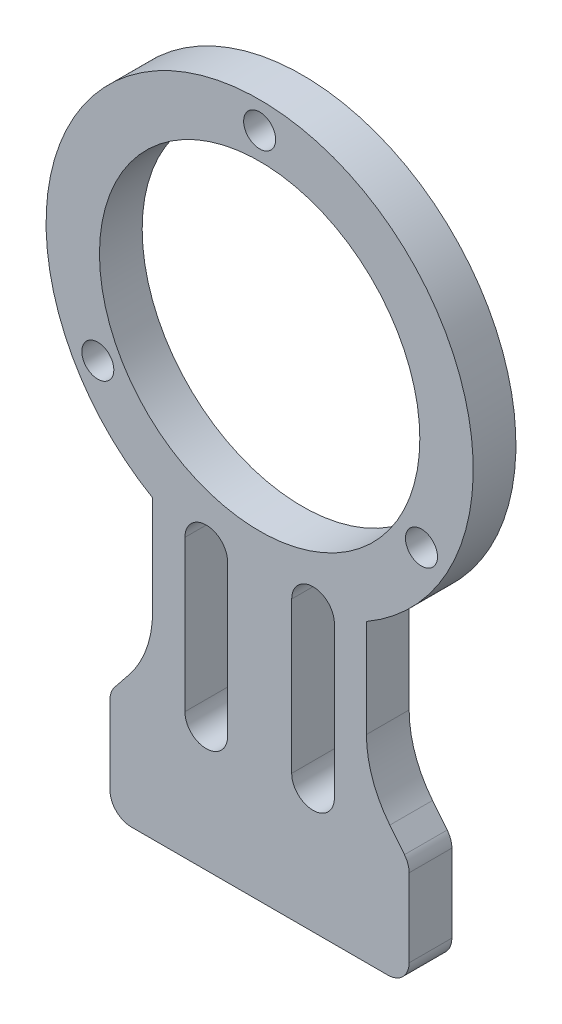
ISO-10303-21;
HEADER;
FILE_DESCRIPTION(('STEP AP214'),'2;1');
FILE_NAME('part.step','',(''),(''),'','','');
FILE_SCHEMA(('AUTOMOTIVE_DESIGN { 1 0 10303 214 1 1 1 1 }'));
ENDSEC;
DATA;
#1=APPLICATION_CONTEXT('core data for automotive mechanical design processes');
#2=APPLICATION_PROTOCOL_DEFINITION('international standard','automotive_design',2000,#1);
#3=PRODUCT_CONTEXT('',#1,'mechanical');
#4=PRODUCT('Part','Part','',(#3));
#5=PRODUCT_RELATED_PRODUCT_CATEGORY('part','',(#4));
#6=PRODUCT_DEFINITION_FORMATION('','',#4);
#7=PRODUCT_DEFINITION_CONTEXT('part definition',#1,'design');
#8=PRODUCT_DEFINITION('design','',#6,#7);
#9=PRODUCT_DEFINITION_SHAPE('','',#8);
#10=(LENGTH_UNIT() NAMED_UNIT(*) SI_UNIT(.MILLI.,.METRE.));
#11=(NAMED_UNIT(*) PLANE_ANGLE_UNIT() SI_UNIT($,.RADIAN.));
#12=(NAMED_UNIT(*) SI_UNIT($,.STERADIAN.) SOLID_ANGLE_UNIT());
#13=UNCERTAINTY_MEASURE_WITH_UNIT(LENGTH_MEASURE(1.E-05),#10,'distance_accuracy_value','');
#14=(GEOMETRIC_REPRESENTATION_CONTEXT(3) GLOBAL_UNCERTAINTY_ASSIGNED_CONTEXT((#13)) GLOBAL_UNIT_ASSIGNED_CONTEXT((#10,
#11,#12)) REPRESENTATION_CONTEXT('',''));
#15=CARTESIAN_POINT('',(0.,0.,0.));
#16=DIRECTION('',(0.,0.,1.));
#17=DIRECTION('',(1.,0.,0.));
#18=AXIS2_PLACEMENT_3D('',#15,#16,#17);
#19=CARTESIAN_POINT('',(0.,0.,4.));
#20=DIRECTION('',(0.,0.,1.));
#21=DIRECTION('',(1.,0.,0.));
#22=AXIS2_PLACEMENT_3D('',#19,#20,#21);
#23=PLANE('',#22);
#24=CARTESIAN_POINT('',(15.1554445662284,-8.74999999999956,4.));
#25=DIRECTION('',(0.,0.,1.));
#26=DIRECTION('',(1.,0.,0.));
#27=AXIS2_PLACEMENT_3D('',#24,#25,#26);
#28=CIRCLE('',#27,1.50000000000068);
#29=CARTESIAN_POINT('',(16.6554445662291,-8.74999999999956,4.));
#30=VERTEX_POINT('',#29);
#31=EDGE_CURVE('E259',#30,#30,#28,.T.);
#32=ORIENTED_EDGE('',*,*,#31,.F.);
#33=EDGE_LOOP('',(#32));
#34=FACE_BOUND('',#33,.T.);
#35=CARTESIAN_POINT('',(0.,0.,4.));
#36=DIRECTION('',(0.,0.,1.));
#37=DIRECTION('',(1.,0.,0.));
#38=AXIS2_PLACEMENT_3D('',#35,#36,#37);
#39=CIRCLE('',#38,15.);
#40=CARTESIAN_POINT('',(15.,0.,4.));
#41=VERTEX_POINT('',#40);
#42=EDGE_CURVE('E271',#41,#41,#39,.T.);
#43=ORIENTED_EDGE('',*,*,#42,.F.);
#44=EDGE_LOOP('',(#43));
#45=FACE_BOUND('',#44,.T.);
#46=CARTESIAN_POINT('',(0.,0.,4.));
#47=DIRECTION('',(0.,0.,1.));
#48=DIRECTION('',(1.,0.,0.));
#49=AXIS2_PLACEMENT_3D('',#46,#47,#48);
#50=CIRCLE('',#49,20.);
#51=CARTESIAN_POINT('',(10.,-17.3205080756888,4.));
#52=VERTEX_POINT('',#51);
#53=CARTESIAN_POINT('',(-10.0182127427132,-17.3099801687275,4.));
#54=VERTEX_POINT('',#53);
#55=EDGE_CURVE('E277',#52,#54,#50,.T.);
#56=ORIENTED_EDGE('',*,*,#55,.T.);
#57=DIRECTION('',(0.,-1.,0.));
#58=VECTOR('',#57,1.);
#59=CARTESIAN_POINT('',(-10.0182127427132,-17.3099801687275,4.));
#60=LINE('',#59,#58);
#61=CARTESIAN_POINT('',(-10.0182127427132,-26.4816614994566,4.));
#62=VERTEX_POINT('',#61);
#63=EDGE_CURVE('E280',#54,#62,#60,.T.);
#64=ORIENTED_EDGE('',*,*,#63,.T.);
#65=CARTESIAN_POINT('',(-20.0182127427132,-26.4816614994566,4.));
#66=DIRECTION('',(0.,0.,-1.));
#67=DIRECTION('',(1.,0.,0.));
#68=AXIS2_PLACEMENT_3D('',#65,#66,#67);
#69=CIRCLE('',#68,10.);
#70=CARTESIAN_POINT('',(-12.2095246482829,-32.7286119750008,4.));
#71=VERTEX_POINT('',#70);
#72=EDGE_CURVE('E283',#62,#71,#69,.T.);
#73=ORIENTED_EDGE('',*,*,#72,.T.);
#74=DIRECTION('',(-0.624695047554422,-0.780868809443032,0.));
#75=VECTOR('',#74,1.);
#76=CARTESIAN_POINT('',(-12.2095246482829,-32.7286119750008,4.));
#77=LINE('',#76,#75);
#78=CARTESIAN_POINT('',(-13.5799503615993,-34.4416441166463,4.));
#79=VERTEX_POINT('',#78);
#80=EDGE_CURVE('E285',#71,#79,#77,.T.);
#81=ORIENTED_EDGE('',*,*,#80,.T.);
#82=CARTESIAN_POINT('',(-12.0182127427132,-35.6910342117551,4.));
#83=DIRECTION('',(0.,0.,1.));
#84=DIRECTION('',(-1.,0.,0.));
#85=AXIS2_PLACEMENT_3D('',#82,#83,#84);
#86=CIRCLE('',#85,2.);
#87=CARTESIAN_POINT('',(-14.0182127427132,-35.6910342117551,4.));
#88=VERTEX_POINT('',#87);
#89=EDGE_CURVE('E287',#79,#88,#86,.T.);
#90=ORIENTED_EDGE('',*,*,#89,.T.);
#91=DIRECTION('',(0.,-1.,0.));
#92=VECTOR('',#91,1.);
#93=CARTESIAN_POINT('',(-14.0182127427132,-35.6910342117551,4.));
#94=LINE('',#93,#92);
#95=CARTESIAN_POINT('',(-14.0182127427132,-43.,4.));
#96=VERTEX_POINT('',#95);
#97=EDGE_CURVE('E289',#88,#96,#94,.T.);
#98=ORIENTED_EDGE('',*,*,#97,.T.);
#99=CARTESIAN_POINT('',(-12.0182127427132,-43.,4.));
#100=DIRECTION('',(0.,0.,1.));
#101=DIRECTION('',(-1.,0.,0.));
#102=AXIS2_PLACEMENT_3D('',#99,#100,#101);
#103=CIRCLE('',#102,2.);
#104=CARTESIAN_POINT('',(-12.0182127427132,-45.,4.));
#105=VERTEX_POINT('',#104);
#106=EDGE_CURVE('E291',#96,#105,#103,.T.);
#107=ORIENTED_EDGE('',*,*,#106,.T.);
#108=DIRECTION('',(1.,0.,0.));
#109=VECTOR('',#108,1.);
#110=CARTESIAN_POINT('',(12.,-45.,4.));
#111=LINE('',#110,#109);
#112=CARTESIAN_POINT('',(12.,-45.,4.));
#113=VERTEX_POINT('',#112);
#114=EDGE_CURVE('E293',#105,#113,#111,.T.);
#115=ORIENTED_EDGE('',*,*,#114,.T.);
#116=CARTESIAN_POINT('',(12.,-43.,4.));
#117=DIRECTION('',(0.,0.,1.));
#118=DIRECTION('',(1.,0.,0.));
#119=AXIS2_PLACEMENT_3D('',#116,#117,#118);
#120=CIRCLE('',#119,2.);
#121=CARTESIAN_POINT('',(14.,-43.,4.));
#122=VERTEX_POINT('',#121);
#123=EDGE_CURVE('E295',#113,#122,#120,.T.);
#124=ORIENTED_EDGE('',*,*,#123,.T.);
#125=DIRECTION('',(0.,1.,0.));
#126=VECTOR('',#125,1.);
#127=CARTESIAN_POINT('',(14.,-35.7015621187164,4.));
#128=LINE('',#127,#126);
#129=CARTESIAN_POINT('',(14.,-35.7015621187164,4.));
#130=VERTEX_POINT('',#129);
#131=EDGE_CURVE('E297',#122,#130,#128,.T.);
#132=ORIENTED_EDGE('',*,*,#131,.T.);
#133=CARTESIAN_POINT('',(12.,-35.7015621187164,4.));
#134=DIRECTION('',(0.,0.,1.));
#135=DIRECTION('',(1.,0.,0.));
#136=AXIS2_PLACEMENT_3D('',#133,#134,#135);
#137=CIRCLE('',#136,2.);
#138=CARTESIAN_POINT('',(13.5617376188861,-34.4521720236076,4.));
#139=VERTEX_POINT('',#138);
#140=EDGE_CURVE('E299',#130,#139,#137,.T.);
#141=ORIENTED_EDGE('',*,*,#140,.T.);
#142=DIRECTION('',(-0.624695047554425,0.78086880944303,0.));
#143=VECTOR('',#142,1.);
#144=CARTESIAN_POINT('',(12.1913119055697,-32.7391398819622,4.));
#145=LINE('',#144,#143);
#146=CARTESIAN_POINT('',(12.1913119055697,-32.7391398819622,4.));
#147=VERTEX_POINT('',#146);
#148=EDGE_CURVE('E301',#139,#147,#145,.T.);
#149=ORIENTED_EDGE('',*,*,#148,.T.);
#150=CARTESIAN_POINT('',(20.,-26.4921894064179,4.));
#151=DIRECTION('',(0.,0.,-1.));
#152=DIRECTION('',(1.,0.,0.));
#153=AXIS2_PLACEMENT_3D('',#150,#151,#152);
#154=CIRCLE('',#153,10.);
#155=CARTESIAN_POINT('',(10.,-26.4921894064178,4.));
#156=VERTEX_POINT('',#155);
#157=EDGE_CURVE('E303',#147,#156,#154,.T.);
#158=ORIENTED_EDGE('',*,*,#157,.T.);
#159=DIRECTION('',(0.,1.,0.));
#160=VECTOR('',#159,1.);
#161=CARTESIAN_POINT('',(10.,-17.3205080756888,4.));
#162=LINE('',#161,#160);
#163=EDGE_CURVE('E305',#156,#52,#162,.T.);
#164=ORIENTED_EDGE('',*,*,#163,.T.);
#165=EDGE_LOOP('',(#56,#64,#73,#81,#90,#98,#107,#115,#124,#132,#141,#149,#158,#164));
#166=FACE_BOUND('',#165,.T.);
#167=CARTESIAN_POINT('',(0.,17.5,4.));
#168=DIRECTION('',(0.,0.,1.));
#169=DIRECTION('',(1.,0.,0.));
#170=AXIS2_PLACEMENT_3D('',#167,#168,#169);
#171=CIRCLE('',#170,1.5);
#172=CARTESIAN_POINT('',(1.5,17.5,4.));
#173=VERTEX_POINT('',#172);
#174=EDGE_CURVE('E265',#173,#173,#171,.T.);
#175=ORIENTED_EDGE('',*,*,#174,.F.);
#176=EDGE_LOOP('',(#175));
#177=FACE_BOUND('',#176,.T.);
#178=CARTESIAN_POINT('',(-15.1554445662269,-8.75000000000044,4.));
#179=DIRECTION('',(0.,0.,1.));
#180=DIRECTION('',(1.,0.,0.));
#181=AXIS2_PLACEMENT_3D('',#178,#179,#180);
#182=CIRCLE('',#181,1.500000000001);
#183=CARTESIAN_POINT('',(-13.6554445662259,-8.75000000000044,4.));
#184=VERTEX_POINT('',#183);
#185=EDGE_CURVE('E253',#184,#184,#182,.T.);
#186=ORIENTED_EDGE('',*,*,#185,.F.);
#187=EDGE_LOOP('',(#186));
#188=FACE_BOUND('',#187,.T.);
#189=DIRECTION('',(0.,-1.,0.));
#190=VECTOR('',#189,1.);
#191=CARTESIAN_POINT('',(-7.,-19.,4.));
#192=LINE('',#191,#190);
#193=CARTESIAN_POINT('',(-7.,-19.,4.));
#194=VERTEX_POINT('',#193);
#195=CARTESIAN_POINT('',(-7.,-33.1393258404143,4.));
#196=VERTEX_POINT('',#195);
#197=EDGE_CURVE('E224',#194,#196,#192,.T.);
#198=ORIENTED_EDGE('',*,*,#197,.F.);
#199=CARTESIAN_POINT('',(-5.,-19.,4.));
#200=DIRECTION('',(0.,0.,1.));
#201=DIRECTION('',(1.,0.,0.));
#202=AXIS2_PLACEMENT_3D('',#199,#200,#201);
#203=CIRCLE('',#202,2.);
#204=CARTESIAN_POINT('',(-3.,-19.,4.));
#205=VERTEX_POINT('',#204);
#206=EDGE_CURVE('E222',#205,#194,#203,.T.);
#207=ORIENTED_EDGE('',*,*,#206,.F.);
#208=DIRECTION('',(0.,1.,0.));
#209=VECTOR('',#208,1.);
#210=CARTESIAN_POINT('',(-3.,-19.,4.));
#211=LINE('',#210,#209);
#212=CARTESIAN_POINT('',(-3.,-33.1393258404143,4.));
#213=VERTEX_POINT('',#212);
#214=EDGE_CURVE('E230',#213,#205,#211,.T.);
#215=ORIENTED_EDGE('',*,*,#214,.F.);
#216=CARTESIAN_POINT('',(-5.,-33.1393258404143,4.));
#217=DIRECTION('',(0.,0.,1.));
#218=DIRECTION('',(1.,0.,0.));
#219=AXIS2_PLACEMENT_3D('',#216,#217,#218);
#220=CIRCLE('',#219,2.);
#221=EDGE_CURVE('E227',#196,#213,#220,.T.);
#222=ORIENTED_EDGE('',*,*,#221,.F.);
#223=EDGE_LOOP('',(#198,#207,#215,#222));
#224=FACE_BOUND('',#223,.T.);
#225=DIRECTION('',(0.,-1.,0.));
#226=VECTOR('',#225,1.);
#227=CARTESIAN_POINT('',(3.,-19.,4.));
#228=LINE('',#227,#226);
#229=CARTESIAN_POINT('',(3.,-19.,4.));
#230=VERTEX_POINT('',#229);
#231=CARTESIAN_POINT('',(3.,-33.1393258404143,4.));
#232=VERTEX_POINT('',#231);
#233=EDGE_CURVE('E192',#230,#232,#228,.T.);
#234=ORIENTED_EDGE('',*,*,#233,.F.);
#235=CARTESIAN_POINT('',(5.,-19.,4.));
#236=DIRECTION('',(0.,0.,1.));
#237=DIRECTION('',(-1.,0.,0.));
#238=AXIS2_PLACEMENT_3D('',#235,#236,#237);
#239=CIRCLE('',#238,2.);
#240=CARTESIAN_POINT('',(7.,-19.,4.));
#241=VERTEX_POINT('',#240);
#242=EDGE_CURVE('E184',#241,#230,#239,.T.);
#243=ORIENTED_EDGE('',*,*,#242,.F.);
#244=DIRECTION('',(0.,1.,0.));
#245=VECTOR('',#244,1.);
#246=CARTESIAN_POINT('',(7.,-19.,4.));
#247=LINE('',#246,#245);
#248=CARTESIAN_POINT('',(7.,-33.1393258404143,4.));
#249=VERTEX_POINT('',#248);
#250=EDGE_CURVE('E206',#249,#241,#247,.T.);
#251=ORIENTED_EDGE('',*,*,#250,.F.);
#252=CARTESIAN_POINT('',(5.,-33.1393258404143,4.));
#253=DIRECTION('',(0.,0.,1.));
#254=DIRECTION('',(-1.,0.,0.));
#255=AXIS2_PLACEMENT_3D('',#252,#253,#254);
#256=CIRCLE('',#255,2.);
#257=EDGE_CURVE('E204',#232,#249,#256,.T.);
#258=ORIENTED_EDGE('',*,*,#257,.F.);
#259=EDGE_LOOP('',(#234,#243,#251,#258));
#260=FACE_BOUND('',#259,.T.);
#261=ADVANCED_FACE('F35',(#34,#45,#166,#177,#188,#224,#260),#23,.T.);
#262=CARTESIAN_POINT('',(0.,0.,0.));
#263=DIRECTION('',(0.,0.,1.));
#264=DIRECTION('',(1.,0.,0.));
#265=AXIS2_PLACEMENT_3D('',#262,#263,#264);
#266=PLANE('',#265);
#267=CARTESIAN_POINT('',(-5.,-19.,0.));
#268=DIRECTION('',(0.,0.,1.));
#269=DIRECTION('',(1.,0.,0.));
#270=AXIS2_PLACEMENT_3D('',#267,#268,#269);
#271=CIRCLE('',#270,2.);
#272=CARTESIAN_POINT('',(-3.,-19.,0.));
#273=VERTEX_POINT('',#272);
#274=CARTESIAN_POINT('',(-7.,-19.,0.));
#275=VERTEX_POINT('',#274);
#276=EDGE_CURVE('E200',#273,#275,#271,.T.);
#277=ORIENTED_EDGE('',*,*,#276,.T.);
#278=DIRECTION('',(0.,-1.,0.));
#279=VECTOR('',#278,1.);
#280=CARTESIAN_POINT('',(-7.,-19.,0.));
#281=LINE('',#280,#279);
#282=CARTESIAN_POINT('',(-7.,-33.1393258404143,0.));
#283=VERTEX_POINT('',#282);
#284=EDGE_CURVE('E235',#275,#283,#281,.T.);
#285=ORIENTED_EDGE('',*,*,#284,.T.);
#286=CARTESIAN_POINT('',(-5.,-33.1393258404143,0.));
#287=DIRECTION('',(0.,0.,1.));
#288=DIRECTION('',(1.,0.,0.));
#289=AXIS2_PLACEMENT_3D('',#286,#287,#288);
#290=CIRCLE('',#289,2.);
#291=CARTESIAN_POINT('',(-3.,-33.1393258404143,0.));
#292=VERTEX_POINT('',#291);
#293=EDGE_CURVE('E238',#283,#292,#290,.T.);
#294=ORIENTED_EDGE('',*,*,#293,.T.);
#295=DIRECTION('',(0.,1.,0.));
#296=VECTOR('',#295,1.);
#297=CARTESIAN_POINT('',(-3.,-19.,0.));
#298=LINE('',#297,#296);
#299=EDGE_CURVE('E225',#292,#273,#298,.T.);
#300=ORIENTED_EDGE('',*,*,#299,.T.);
#301=EDGE_LOOP('',(#277,#285,#294,#300));
#302=FACE_BOUND('',#301,.T.);
#303=CARTESIAN_POINT('',(0.,0.,0.));
#304=DIRECTION('',(0.,0.,1.));
#305=DIRECTION('',(1.,0.,0.));
#306=AXIS2_PLACEMENT_3D('',#303,#304,#305);
#307=CIRCLE('',#306,20.);
#308=CARTESIAN_POINT('',(10.,-17.3205080756888,0.));
#309=VERTEX_POINT('',#308);
#310=CARTESIAN_POINT('',(-10.0182127427132,-17.3099801687275,0.));
#311=VERTEX_POINT('',#310);
#312=EDGE_CURVE('E274',#309,#311,#307,.T.);
#313=ORIENTED_EDGE('',*,*,#312,.F.);
#314=DIRECTION('',(0.,1.,0.));
#315=VECTOR('',#314,1.);
#316=CARTESIAN_POINT('',(10.,-17.3205080756888,0.));
#317=LINE('',#316,#315);
#318=CARTESIAN_POINT('',(10.,-26.4921894064178,0.));
#319=VERTEX_POINT('',#318);
#320=EDGE_CURVE('E281',#319,#309,#317,.T.);
#321=ORIENTED_EDGE('',*,*,#320,.F.);
#322=CARTESIAN_POINT('',(20.,-26.4921894064179,0.));
#323=DIRECTION('',(0.,0.,-1.));
#324=DIRECTION('',(1.,0.,0.));
#325=AXIS2_PLACEMENT_3D('',#322,#323,#324);
#326=CIRCLE('',#325,10.);
#327=CARTESIAN_POINT('',(12.1913119055697,-32.7391398819622,0.));
#328=VERTEX_POINT('',#327);
#329=EDGE_CURVE('E332',#328,#319,#326,.T.);
#330=ORIENTED_EDGE('',*,*,#329,.F.);
#331=DIRECTION('',(-0.624695047554425,0.78086880944303,0.));
#332=VECTOR('',#331,1.);
#333=CARTESIAN_POINT('',(12.1913119055697,-32.7391398819622,0.));
#334=LINE('',#333,#332);
#335=CARTESIAN_POINT('',(13.5617376188861,-34.4521720236076,0.));
#336=VERTEX_POINT('',#335);
#337=EDGE_CURVE('E330',#336,#328,#334,.T.);
#338=ORIENTED_EDGE('',*,*,#337,.F.);
#339=CARTESIAN_POINT('',(12.,-35.7015621187164,0.));
#340=DIRECTION('',(0.,0.,1.));
#341=DIRECTION('',(1.,0.,0.));
#342=AXIS2_PLACEMENT_3D('',#339,#340,#341);
#343=CIRCLE('',#342,2.);
#344=CARTESIAN_POINT('',(14.,-35.7015621187164,0.));
#345=VERTEX_POINT('',#344);
#346=EDGE_CURVE('E328',#345,#336,#343,.T.);
#347=ORIENTED_EDGE('',*,*,#346,.F.);
#348=DIRECTION('',(0.,1.,0.));
#349=VECTOR('',#348,1.);
#350=CARTESIAN_POINT('',(14.,-35.7015621187164,0.));
#351=LINE('',#350,#349);
#352=CARTESIAN_POINT('',(14.,-43.,0.));
#353=VERTEX_POINT('',#352);
#354=EDGE_CURVE('E326',#353,#345,#351,.T.);
#355=ORIENTED_EDGE('',*,*,#354,.F.);
#356=CARTESIAN_POINT('',(12.,-43.,0.));
#357=DIRECTION('',(0.,0.,1.));
#358=DIRECTION('',(1.,0.,0.));
#359=AXIS2_PLACEMENT_3D('',#356,#357,#358);
#360=CIRCLE('',#359,2.);
#361=CARTESIAN_POINT('',(12.,-45.,0.));
#362=VERTEX_POINT('',#361);
#363=EDGE_CURVE('E324',#362,#353,#360,.T.);
#364=ORIENTED_EDGE('',*,*,#363,.F.);
#365=DIRECTION('',(1.,0.,0.));
#366=VECTOR('',#365,1.);
#367=CARTESIAN_POINT('',(12.,-45.,0.));
#368=LINE('',#367,#366);
#369=CARTESIAN_POINT('',(-12.0182127427132,-45.,0.));
#370=VERTEX_POINT('',#369);
#371=EDGE_CURVE('E322',#370,#362,#368,.T.);
#372=ORIENTED_EDGE('',*,*,#371,.F.);
#373=CARTESIAN_POINT('',(-12.0182127427132,-43.,0.));
#374=DIRECTION('',(0.,0.,1.));
#375=DIRECTION('',(-1.,0.,0.));
#376=AXIS2_PLACEMENT_3D('',#373,#374,#375);
#377=CIRCLE('',#376,2.);
#378=CARTESIAN_POINT('',(-14.0182127427132,-43.,0.));
#379=VERTEX_POINT('',#378);
#380=EDGE_CURVE('E320',#379,#370,#377,.T.);
#381=ORIENTED_EDGE('',*,*,#380,.F.);
#382=DIRECTION('',(0.,-1.,0.));
#383=VECTOR('',#382,1.);
#384=CARTESIAN_POINT('',(-14.0182127427132,-35.6910342117551,0.));
#385=LINE('',#384,#383);
#386=CARTESIAN_POINT('',(-14.0182127427132,-35.6910342117551,0.));
#387=VERTEX_POINT('',#386);
#388=EDGE_CURVE('E318',#387,#379,#385,.T.);
#389=ORIENTED_EDGE('',*,*,#388,.F.);
#390=CARTESIAN_POINT('',(-12.0182127427132,-35.6910342117551,0.));
#391=DIRECTION('',(0.,0.,1.));
#392=DIRECTION('',(-1.,0.,0.));
#393=AXIS2_PLACEMENT_3D('',#390,#391,#392);
#394=CIRCLE('',#393,2.);
#395=CARTESIAN_POINT('',(-13.5799503615993,-34.4416441166463,0.));
#396=VERTEX_POINT('',#395);
#397=EDGE_CURVE('E316',#396,#387,#394,.T.);
#398=ORIENTED_EDGE('',*,*,#397,.F.);
#399=DIRECTION('',(-0.624695047554422,-0.780868809443032,0.));
#400=VECTOR('',#399,1.);
#401=CARTESIAN_POINT('',(-12.2095246482829,-32.7286119750008,0.));
#402=LINE('',#401,#400);
#403=CARTESIAN_POINT('',(-12.2095246482829,-32.7286119750008,0.));
#404=VERTEX_POINT('',#403);
#405=EDGE_CURVE('E314',#404,#396,#402,.T.);
#406=ORIENTED_EDGE('',*,*,#405,.F.);
#407=CARTESIAN_POINT('',(-20.0182127427132,-26.4816614994566,0.));
#408=DIRECTION('',(0.,0.,-1.));
#409=DIRECTION('',(1.,0.,0.));
#410=AXIS2_PLACEMENT_3D('',#407,#408,#409);
#411=CIRCLE('',#410,10.);
#412=CARTESIAN_POINT('',(-10.0182127427132,-26.4816614994566,0.));
#413=VERTEX_POINT('',#412);
#414=EDGE_CURVE('E312',#413,#404,#411,.T.);
#415=ORIENTED_EDGE('',*,*,#414,.F.);
#416=DIRECTION('',(0.,-1.,0.));
#417=VECTOR('',#416,1.);
#418=CARTESIAN_POINT('',(-10.0182127427132,-17.3099801687275,0.));
#419=LINE('',#418,#417);
#420=EDGE_CURVE('E310',#311,#413,#419,.T.);
#421=ORIENTED_EDGE('',*,*,#420,.F.);
#422=EDGE_LOOP('',(#313,#321,#330,#338,#347,#355,#364,#372,#381,#389,#398,#406,#415,#421));
#423=FACE_BOUND('',#422,.T.);
#424=CARTESIAN_POINT('',(0.,0.,0.));
#425=DIRECTION('',(0.,0.,1.));
#426=DIRECTION('',(1.,0.,0.));
#427=AXIS2_PLACEMENT_3D('',#424,#425,#426);
#428=CIRCLE('',#427,15.);
#429=CARTESIAN_POINT('',(15.,0.,0.));
#430=VERTEX_POINT('',#429);
#431=EDGE_CURVE('E268',#430,#430,#428,.T.);
#432=ORIENTED_EDGE('',*,*,#431,.T.);
#433=EDGE_LOOP('',(#432));
#434=FACE_BOUND('',#433,.T.);
#435=CARTESIAN_POINT('',(0.,17.5,0.));
#436=DIRECTION('',(0.,0.,1.));
#437=DIRECTION('',(1.,0.,0.));
#438=AXIS2_PLACEMENT_3D('',#435,#436,#437);
#439=CIRCLE('',#438,1.5);
#440=CARTESIAN_POINT('',(1.5,17.5,0.));
#441=VERTEX_POINT('',#440);
#442=EDGE_CURVE('E262',#441,#441,#439,.T.);
#443=ORIENTED_EDGE('',*,*,#442,.T.);
#444=EDGE_LOOP('',(#443));
#445=FACE_BOUND('',#444,.T.);
#446=CARTESIAN_POINT('',(15.1554445662284,-8.74999999999956,0.));
#447=DIRECTION('',(0.,0.,1.));
#448=DIRECTION('',(1.,0.,0.));
#449=AXIS2_PLACEMENT_3D('',#446,#447,#448);
#450=CIRCLE('',#449,1.50000000000068);
#451=CARTESIAN_POINT('',(16.6554445662291,-8.74999999999956,0.));
#452=VERTEX_POINT('',#451);
#453=EDGE_CURVE('E256',#452,#452,#450,.T.);
#454=ORIENTED_EDGE('',*,*,#453,.T.);
#455=EDGE_LOOP('',(#454));
#456=FACE_BOUND('',#455,.T.);
#457=CARTESIAN_POINT('',(-15.1554445662269,-8.75000000000044,0.));
#458=DIRECTION('',(0.,0.,1.));
#459=DIRECTION('',(1.,0.,0.));
#460=AXIS2_PLACEMENT_3D('',#457,#458,#459);
#461=CIRCLE('',#460,1.500000000001);
#462=CARTESIAN_POINT('',(-13.6554445662259,-8.75000000000044,0.));
#463=VERTEX_POINT('',#462);
#464=EDGE_CURVE('E252',#463,#463,#461,.T.);
#465=ORIENTED_EDGE('',*,*,#464,.T.);
#466=EDGE_LOOP('',(#465));
#467=FACE_BOUND('',#466,.T.);
#468=CARTESIAN_POINT('',(5.,-19.,0.));
#469=DIRECTION('',(0.,0.,1.));
#470=DIRECTION('',(-1.,0.,0.));
#471=AXIS2_PLACEMENT_3D('',#468,#469,#470);
#472=CIRCLE('',#471,2.);
#473=CARTESIAN_POINT('',(7.,-19.,0.));
#474=VERTEX_POINT('',#473);
#475=CARTESIAN_POINT('',(3.,-19.,0.));
#476=VERTEX_POINT('',#475);
#477=EDGE_CURVE('E58',#474,#476,#472,.T.);
#478=ORIENTED_EDGE('',*,*,#477,.T.);
#479=DIRECTION('',(0.,-1.,0.));
#480=VECTOR('',#479,1.);
#481=CARTESIAN_POINT('',(3.,-19.,0.));
#482=LINE('',#481,#480);
#483=CARTESIAN_POINT('',(3.,-33.1393258404143,0.));
#484=VERTEX_POINT('',#483);
#485=EDGE_CURVE('E199',#476,#484,#482,.T.);
#486=ORIENTED_EDGE('',*,*,#485,.T.);
#487=CARTESIAN_POINT('',(5.,-33.1393258404143,0.));
#488=DIRECTION('',(0.,0.,1.));
#489=DIRECTION('',(-1.,0.,0.));
#490=AXIS2_PLACEMENT_3D('',#487,#488,#489);
#491=CIRCLE('',#490,2.);
#492=CARTESIAN_POINT('',(7.,-33.1393258404143,0.));
#493=VERTEX_POINT('',#492);
#494=EDGE_CURVE('E214',#484,#493,#491,.T.);
#495=ORIENTED_EDGE('',*,*,#494,.T.);
#496=DIRECTION('',(0.,1.,0.));
#497=VECTOR('',#496,1.);
#498=CARTESIAN_POINT('',(7.,-19.,0.));
#499=LINE('',#498,#497);
#500=EDGE_CURVE('E193',#493,#474,#499,.T.);
#501=ORIENTED_EDGE('',*,*,#500,.T.);
#502=EDGE_LOOP('',(#478,#486,#495,#501));
#503=FACE_BOUND('',#502,.T.);
#504=ADVANCED_FACE('F380',(#302,#423,#434,#445,#456,#467,#503),#266,.F.);
#505=CARTESIAN_POINT('',(0.,0.,4.));
#506=DIRECTION('',(0.,0.,-1.));
#507=DIRECTION('',(-1.,0.,0.));
#508=AXIS2_PLACEMENT_3D('',#505,#506,#507);
#509=CYLINDRICAL_SURFACE('',#508,20.);
#510=ORIENTED_EDGE('',*,*,#312,.T.);
#511=DIRECTION('',(0.,0.,-1.));
#512=VECTOR('',#511,1.);
#513=CARTESIAN_POINT('',(-10.0182127427132,-17.3099801687275,4.));
#514=LINE('',#513,#512);
#515=EDGE_CURVE('E11',#54,#311,#514,.T.);
#516=ORIENTED_EDGE('',*,*,#515,.F.);
#517=ORIENTED_EDGE('',*,*,#55,.F.);
#518=DIRECTION('',(0.,0.,-1.));
#519=VECTOR('',#518,1.);
#520=CARTESIAN_POINT('',(10.,-17.3205080756888,4.));
#521=LINE('',#520,#519);
#522=EDGE_CURVE('E307',#52,#309,#521,.T.);
#523=ORIENTED_EDGE('',*,*,#522,.T.);
#524=EDGE_LOOP('',(#510,#516,#517,#523));
#525=FACE_BOUND('',#524,.T.);
#526=ADVANCED_FACE('F37',(#525),#509,.T.);
#527=CARTESIAN_POINT('',(-10.0182127427132,-17.3099801687275,4.));
#528=DIRECTION('',(1.,0.,0.));
#529=DIRECTION('',(0.,0.,-1.));
#530=AXIS2_PLACEMENT_3D('',#527,#528,#529);
#531=PLANE('',#530);
#532=ORIENTED_EDGE('',*,*,#420,.T.);
#533=DIRECTION('',(0.,0.,-1.));
#534=VECTOR('',#533,1.);
#535=CARTESIAN_POINT('',(-10.0182127427132,-26.4816614994566,4.));
#536=LINE('',#535,#534);
#537=EDGE_CURVE('E43',#62,#413,#536,.T.);
#538=ORIENTED_EDGE('',*,*,#537,.F.);
#539=ORIENTED_EDGE('',*,*,#63,.F.);
#540=ORIENTED_EDGE('',*,*,#515,.T.);
#541=EDGE_LOOP('',(#532,#538,#539,#540));
#542=FACE_BOUND('',#541,.T.);
#543=ADVANCED_FACE('F398',(#542),#531,.F.);
#544=CARTESIAN_POINT('',(-20.0182127427132,-26.4816614994566,4.));
#545=DIRECTION('',(0.,0.,-1.));
#546=DIRECTION('',(-1.,0.,0.));
#547=AXIS2_PLACEMENT_3D('',#544,#545,#546);
#548=CYLINDRICAL_SURFACE('',#547,10.);
#549=ORIENTED_EDGE('',*,*,#414,.T.);
#550=DIRECTION('',(0.,0.,-1.));
#551=VECTOR('',#550,1.);
#552=CARTESIAN_POINT('',(-12.2095246482829,-32.7286119750008,4.));
#553=LINE('',#552,#551);
#554=EDGE_CURVE('E367',#71,#404,#553,.T.);
#555=ORIENTED_EDGE('',*,*,#554,.F.);
#556=ORIENTED_EDGE('',*,*,#72,.F.);
#557=ORIENTED_EDGE('',*,*,#537,.T.);
#558=EDGE_LOOP('',(#549,#555,#556,#557));
#559=FACE_BOUND('',#558,.T.);
#560=ADVANCED_FACE('F374',(#559),#548,.F.);
#561=CARTESIAN_POINT('',(-12.2095246482829,-32.7286119750008,4.));
#562=DIRECTION('',(0.780868809443032,-0.624695047554422,0.));
#563=DIRECTION('',(0.624695047554422,0.780868809443032,0.));
#564=AXIS2_PLACEMENT_3D('',#561,#562,#563);
#565=PLANE('',#564);
#566=ORIENTED_EDGE('',*,*,#405,.T.);
#567=DIRECTION('',(0.,0.,-1.));
#568=VECTOR('',#567,1.);
#569=CARTESIAN_POINT('',(-13.5799503615993,-34.4416441166463,4.));
#570=LINE('',#569,#568);
#571=EDGE_CURVE('E364',#79,#396,#570,.T.);
#572=ORIENTED_EDGE('',*,*,#571,.F.);
#573=ORIENTED_EDGE('',*,*,#80,.F.);
#574=ORIENTED_EDGE('',*,*,#554,.T.);
#575=EDGE_LOOP('',(#566,#572,#573,#574));
#576=FACE_BOUND('',#575,.T.);
#577=ADVANCED_FACE('F386',(#576),#565,.F.);
#578=CARTESIAN_POINT('',(-12.0182127427132,-35.6910342117551,4.));
#579=DIRECTION('',(0.,0.,-1.));
#580=DIRECTION('',(-1.,0.,0.));
#581=AXIS2_PLACEMENT_3D('',#578,#579,#580);
#582=CYLINDRICAL_SURFACE('',#581,2.);
#583=ORIENTED_EDGE('',*,*,#397,.T.);
#584=DIRECTION('',(0.,0.,-1.));
#585=VECTOR('',#584,1.);
#586=CARTESIAN_POINT('',(-14.0182127427132,-35.6910342117551,4.));
#587=LINE('',#586,#585);
#588=EDGE_CURVE('E361',#88,#387,#587,.T.);
#589=ORIENTED_EDGE('',*,*,#588,.F.);
#590=ORIENTED_EDGE('',*,*,#89,.F.);
#591=ORIENTED_EDGE('',*,*,#571,.T.);
#592=EDGE_LOOP('',(#583,#589,#590,#591));
#593=FACE_BOUND('',#592,.T.);
#594=ADVANCED_FACE('F390',(#593),#582,.T.);
#595=CARTESIAN_POINT('',(-14.0182127427132,-35.6910342117551,4.));
#596=DIRECTION('',(1.,0.,0.));
#597=DIRECTION('',(0.,0.,-1.));
#598=AXIS2_PLACEMENT_3D('',#595,#596,#597);
#599=PLANE('',#598);
#600=ORIENTED_EDGE('',*,*,#388,.T.);
#601=DIRECTION('',(0.,0.,-1.));
#602=VECTOR('',#601,1.);
#603=CARTESIAN_POINT('',(-14.0182127427132,-43.,4.));
#604=LINE('',#603,#602);
#605=EDGE_CURVE('E358',#96,#379,#604,.T.);
#606=ORIENTED_EDGE('',*,*,#605,.F.);
#607=ORIENTED_EDGE('',*,*,#97,.F.);
#608=ORIENTED_EDGE('',*,*,#588,.T.);
#609=EDGE_LOOP('',(#600,#606,#607,#608));
#610=FACE_BOUND('',#609,.T.);
#611=ADVANCED_FACE('F441',(#610),#599,.F.);
#612=CARTESIAN_POINT('',(-12.0182127427132,-43.,4.));
#613=DIRECTION('',(0.,0.,-1.));
#614=DIRECTION('',(-1.,0.,0.));
#615=AXIS2_PLACEMENT_3D('',#612,#613,#614);
#616=CYLINDRICAL_SURFACE('',#615,2.);
#617=ORIENTED_EDGE('',*,*,#380,.T.);
#618=DIRECTION('',(0.,0.,-1.));
#619=VECTOR('',#618,1.);
#620=CARTESIAN_POINT('',(-12.0182127427132,-45.,4.));
#621=LINE('',#620,#619);
#622=EDGE_CURVE('E355',#105,#370,#621,.T.);
#623=ORIENTED_EDGE('',*,*,#622,.F.);
#624=ORIENTED_EDGE('',*,*,#106,.F.);
#625=ORIENTED_EDGE('',*,*,#605,.T.);
#626=EDGE_LOOP('',(#617,#623,#624,#625));
#627=FACE_BOUND('',#626,.T.);
#628=ADVANCED_FACE('F439',(#627),#616,.T.);
#629=CARTESIAN_POINT('',(12.,-45.,4.));
#630=DIRECTION('',(0.,1.,0.));
#631=DIRECTION('',(0.,0.,1.));
#632=AXIS2_PLACEMENT_3D('',#629,#630,#631);
#633=PLANE('',#632);
#634=CARTESIAN_POINT('',(-10.0091063713566,-45.,2.));
#635=DIRECTION('',(0.,-1.,0.));
#636=DIRECTION('',(0.,0.,-1.));
#637=AXIS2_PLACEMENT_3D('',#634,#635,#636);
#638=CIRCLE('',#637,1.);
#639=CARTESIAN_POINT('',(-10.0091063713566,-45.,1.));
#640=VERTEX_POINT('',#639);
#641=EDGE_CURVE('E483',#640,#640,#638,.T.);
#642=ORIENTED_EDGE('',*,*,#641,.F.);
#643=EDGE_LOOP('',(#642));
#644=FACE_BOUND('',#643,.T.);
#645=CARTESIAN_POINT('',(9.99089362864339,-45.,2.));
#646=DIRECTION('',(0.,-1.,0.));
#647=DIRECTION('',(0.,0.,1.));
#648=AXIS2_PLACEMENT_3D('',#645,#646,#647);
#649=CIRCLE('',#648,1.);
#650=CARTESIAN_POINT('',(9.99089362864339,-45.,3.));
#651=VERTEX_POINT('',#650);
#652=EDGE_CURVE('E486',#651,#651,#649,.T.);
#653=ORIENTED_EDGE('',*,*,#652,.F.);
#654=EDGE_LOOP('',(#653));
#655=FACE_BOUND('',#654,.T.);
#656=ORIENTED_EDGE('',*,*,#371,.T.);
#657=DIRECTION('',(0.,0.,-1.));
#658=VECTOR('',#657,1.);
#659=CARTESIAN_POINT('',(12.,-45.,4.));
#660=LINE('',#659,#658);
#661=EDGE_CURVE('E352',#113,#362,#660,.T.);
#662=ORIENTED_EDGE('',*,*,#661,.F.);
#663=ORIENTED_EDGE('',*,*,#114,.F.);
#664=ORIENTED_EDGE('',*,*,#622,.T.);
#665=EDGE_LOOP('',(#656,#662,#663,#664));
#666=FACE_BOUND('',#665,.T.);
#667=ADVANCED_FACE('F434',(#644,#655,#666),#633,.F.);
#668=CARTESIAN_POINT('',(12.,-43.,4.));
#669=DIRECTION('',(0.,0.,-1.));
#670=DIRECTION('',(-1.,0.,0.));
#671=AXIS2_PLACEMENT_3D('',#668,#669,#670);
#672=CYLINDRICAL_SURFACE('',#671,2.);
#673=ORIENTED_EDGE('',*,*,#363,.T.);
#674=DIRECTION('',(0.,0.,-1.));
#675=VECTOR('',#674,1.);
#676=CARTESIAN_POINT('',(14.,-43.,4.));
#677=LINE('',#676,#675);
#678=EDGE_CURVE('E349',#122,#353,#677,.T.);
#679=ORIENTED_EDGE('',*,*,#678,.F.);
#680=ORIENTED_EDGE('',*,*,#123,.F.);
#681=ORIENTED_EDGE('',*,*,#661,.T.);
#682=EDGE_LOOP('',(#673,#679,#680,#681));
#683=FACE_BOUND('',#682,.T.);
#684=ADVANCED_FACE('F429',(#683),#672,.T.);
#685=CARTESIAN_POINT('',(14.,-35.7015621187164,4.));
#686=DIRECTION('',(-1.,0.,0.));
#687=DIRECTION('',(0.,-1.,0.));
#688=AXIS2_PLACEMENT_3D('',#685,#686,#687);
#689=PLANE('',#688);
#690=ORIENTED_EDGE('',*,*,#354,.T.);
#691=DIRECTION('',(0.,0.,-1.));
#692=VECTOR('',#691,1.);
#693=CARTESIAN_POINT('',(14.,-35.7015621187164,4.));
#694=LINE('',#693,#692);
#695=EDGE_CURVE('E346',#130,#345,#694,.T.);
#696=ORIENTED_EDGE('',*,*,#695,.F.);
#697=ORIENTED_EDGE('',*,*,#131,.F.);
#698=ORIENTED_EDGE('',*,*,#678,.T.);
#699=EDGE_LOOP('',(#690,#696,#697,#698));
#700=FACE_BOUND('',#699,.T.);
#701=ADVANCED_FACE('F425',(#700),#689,.F.);
#702=CARTESIAN_POINT('',(12.,-35.7015621187164,4.));
#703=DIRECTION('',(0.,0.,-1.));
#704=DIRECTION('',(-1.,0.,0.));
#705=AXIS2_PLACEMENT_3D('',#702,#703,#704);
#706=CYLINDRICAL_SURFACE('',#705,2.);
#707=ORIENTED_EDGE('',*,*,#346,.T.);
#708=DIRECTION('',(0.,0.,-1.));
#709=VECTOR('',#708,1.);
#710=CARTESIAN_POINT('',(13.5617376188861,-34.4521720236076,4.));
#711=LINE('',#710,#709);
#712=EDGE_CURVE('E343',#139,#336,#711,.T.);
#713=ORIENTED_EDGE('',*,*,#712,.F.);
#714=ORIENTED_EDGE('',*,*,#140,.F.);
#715=ORIENTED_EDGE('',*,*,#695,.T.);
#716=EDGE_LOOP('',(#707,#713,#714,#715));
#717=FACE_BOUND('',#716,.T.);
#718=ADVANCED_FACE('F420',(#717),#706,.T.);
#719=CARTESIAN_POINT('',(12.1913119055697,-32.7391398819622,4.));
#720=DIRECTION('',(-0.78086880944303,-0.624695047554425,0.));
#721=DIRECTION('',(0.624695047554425,-0.78086880944303,0.));
#722=AXIS2_PLACEMENT_3D('',#719,#720,#721);
#723=PLANE('',#722);
#724=ORIENTED_EDGE('',*,*,#337,.T.);
#725=DIRECTION('',(0.,0.,-1.));
#726=VECTOR('',#725,1.);
#727=CARTESIAN_POINT('',(12.1913119055697,-32.7391398819622,4.));
#728=LINE('',#727,#726);
#729=EDGE_CURVE('E340',#147,#328,#728,.T.);
#730=ORIENTED_EDGE('',*,*,#729,.F.);
#731=ORIENTED_EDGE('',*,*,#148,.F.);
#732=ORIENTED_EDGE('',*,*,#712,.T.);
#733=EDGE_LOOP('',(#724,#730,#731,#732));
#734=FACE_BOUND('',#733,.T.);
#735=ADVANCED_FACE('F414',(#734),#723,.F.);
#736=CARTESIAN_POINT('',(20.,-26.4921894064179,4.));
#737=DIRECTION('',(0.,0.,-1.));
#738=DIRECTION('',(-1.,0.,0.));
#739=AXIS2_PLACEMENT_3D('',#736,#737,#738);
#740=CYLINDRICAL_SURFACE('',#739,10.);
#741=ORIENTED_EDGE('',*,*,#329,.T.);
#742=DIRECTION('',(0.,0.,-1.));
#743=VECTOR('',#742,1.);
#744=CARTESIAN_POINT('',(10.,-26.4921894064178,4.));
#745=LINE('',#744,#743);
#746=EDGE_CURVE('E337',#156,#319,#745,.T.);
#747=ORIENTED_EDGE('',*,*,#746,.F.);
#748=ORIENTED_EDGE('',*,*,#157,.F.);
#749=ORIENTED_EDGE('',*,*,#729,.T.);
#750=EDGE_LOOP('',(#741,#747,#748,#749));
#751=FACE_BOUND('',#750,.T.);
#752=ADVANCED_FACE('F410',(#751),#740,.F.);
#753=CARTESIAN_POINT('',(10.,-17.3205080756888,4.));
#754=DIRECTION('',(-1.,0.,0.));
#755=DIRECTION('',(0.,-1.,0.));
#756=AXIS2_PLACEMENT_3D('',#753,#754,#755);
#757=PLANE('',#756);
#758=ORIENTED_EDGE('',*,*,#320,.T.);
#759=ORIENTED_EDGE('',*,*,#522,.F.);
#760=ORIENTED_EDGE('',*,*,#163,.F.);
#761=ORIENTED_EDGE('',*,*,#746,.T.);
#762=EDGE_LOOP('',(#758,#759,#760,#761));
#763=FACE_BOUND('',#762,.T.);
#764=ADVANCED_FACE('F405',(#763),#757,.F.);
#765=CARTESIAN_POINT('',(0.,0.,4.));
#766=DIRECTION('',(0.,0.,-1.));
#767=DIRECTION('',(-1.,0.,0.));
#768=AXIS2_PLACEMENT_3D('',#765,#766,#767);
#769=CYLINDRICAL_SURFACE('',#768,15.);
#770=ORIENTED_EDGE('',*,*,#42,.T.);
#771=EDGE_LOOP('',(#770));
#772=FACE_BOUND('',#771,.T.);
#773=ORIENTED_EDGE('',*,*,#431,.F.);
#774=EDGE_LOOP('',(#773));
#775=FACE_BOUND('',#774,.T.);
#776=ADVANCED_FACE('F461',(#772,#775),#769,.F.);
#777=CARTESIAN_POINT('',(0.,17.5,4.));
#778=DIRECTION('',(0.,0.,-1.));
#779=DIRECTION('',(-1.,0.,0.));
#780=AXIS2_PLACEMENT_3D('',#777,#778,#779);
#781=CYLINDRICAL_SURFACE('',#780,1.5);
#782=ORIENTED_EDGE('',*,*,#174,.T.);
#783=EDGE_LOOP('',(#782));
#784=FACE_BOUND('',#783,.T.);
#785=ORIENTED_EDGE('',*,*,#442,.F.);
#786=EDGE_LOOP('',(#785));
#787=FACE_BOUND('',#786,.T.);
#788=ADVANCED_FACE('F548',(#784,#787),#781,.F.);
#789=CARTESIAN_POINT('',(15.1554445662284,-8.74999999999956,4.));
#790=DIRECTION('',(0.,0.,-1.));
#791=DIRECTION('',(-1.,0.,0.));
#792=AXIS2_PLACEMENT_3D('',#789,#790,#791);
#793=CYLINDRICAL_SURFACE('',#792,1.50000000000068);
#794=ORIENTED_EDGE('',*,*,#31,.T.);
#795=EDGE_LOOP('',(#794));
#796=FACE_BOUND('',#795,.T.);
#797=ORIENTED_EDGE('',*,*,#453,.F.);
#798=EDGE_LOOP('',(#797));
#799=FACE_BOUND('',#798,.T.);
#800=ADVANCED_FACE('F545',(#796,#799),#793,.F.);
#801=CARTESIAN_POINT('',(-15.1554445662269,-8.75000000000044,4.));
#802=DIRECTION('',(0.,0.,-1.));
#803=DIRECTION('',(-1.,0.,0.));
#804=AXIS2_PLACEMENT_3D('',#801,#802,#803);
#805=CYLINDRICAL_SURFACE('',#804,1.500000000001);
#806=ORIENTED_EDGE('',*,*,#185,.T.);
#807=EDGE_LOOP('',(#806));
#808=FACE_BOUND('',#807,.T.);
#809=ORIENTED_EDGE('',*,*,#464,.F.);
#810=EDGE_LOOP('',(#809));
#811=FACE_BOUND('',#810,.T.);
#812=ADVANCED_FACE('F541',(#808,#811),#805,.F.);
#813=CARTESIAN_POINT('',(-5.,-19.,4.));
#814=DIRECTION('',(0.,0.,-1.));
#815=DIRECTION('',(-1.,0.,0.));
#816=AXIS2_PLACEMENT_3D('',#813,#814,#815);
#817=CYLINDRICAL_SURFACE('',#816,2.);
#818=ORIENTED_EDGE('',*,*,#276,.F.);
#819=DIRECTION('',(0.,0.,-1.));
#820=VECTOR('',#819,1.);
#821=CARTESIAN_POINT('',(-3.,-19.,4.));
#822=LINE('',#821,#820);
#823=EDGE_CURVE('E232',#205,#273,#822,.T.);
#824=ORIENTED_EDGE('',*,*,#823,.F.);
#825=ORIENTED_EDGE('',*,*,#206,.T.);
#826=DIRECTION('',(0.,0.,-1.));
#827=VECTOR('',#826,1.);
#828=CARTESIAN_POINT('',(-7.,-19.,4.));
#829=LINE('',#828,#827);
#830=EDGE_CURVE('E249',#194,#275,#829,.T.);
#831=ORIENTED_EDGE('',*,*,#830,.T.);
#832=EDGE_LOOP('',(#818,#824,#825,#831));
#833=FACE_BOUND('',#832,.T.);
#834=ADVANCED_FACE('F537',(#833),#817,.F.);
#835=CARTESIAN_POINT('',(-7.,-19.,4.));
#836=DIRECTION('',(1.,0.,0.));
#837=DIRECTION('',(0.,1.,0.));
#838=AXIS2_PLACEMENT_3D('',#835,#836,#837);
#839=PLANE('',#838);
#840=ORIENTED_EDGE('',*,*,#284,.F.);
#841=ORIENTED_EDGE('',*,*,#830,.F.);
#842=ORIENTED_EDGE('',*,*,#197,.T.);
#843=DIRECTION('',(0.,0.,-1.));
#844=VECTOR('',#843,1.);
#845=CARTESIAN_POINT('',(-7.,-33.1393258404143,4.));
#846=LINE('',#845,#844);
#847=EDGE_CURVE('E247',#196,#283,#846,.T.);
#848=ORIENTED_EDGE('',*,*,#847,.T.);
#849=EDGE_LOOP('',(#840,#841,#842,#848));
#850=FACE_BOUND('',#849,.T.);
#851=ADVANCED_FACE('F533',(#850),#839,.T.);
#852=CARTESIAN_POINT('',(-5.,-33.1393258404143,4.));
#853=DIRECTION('',(0.,0.,-1.));
#854=DIRECTION('',(-1.,0.,0.));
#855=AXIS2_PLACEMENT_3D('',#852,#853,#854);
#856=CYLINDRICAL_SURFACE('',#855,2.);
#857=ORIENTED_EDGE('',*,*,#293,.F.);
#858=ORIENTED_EDGE('',*,*,#847,.F.);
#859=ORIENTED_EDGE('',*,*,#221,.T.);
#860=DIRECTION('',(0.,0.,-1.));
#861=VECTOR('',#860,1.);
#862=CARTESIAN_POINT('',(-3.,-33.1393258404143,4.));
#863=LINE('',#862,#861);
#864=EDGE_CURVE('E245',#213,#292,#863,.T.);
#865=ORIENTED_EDGE('',*,*,#864,.T.);
#866=EDGE_LOOP('',(#857,#858,#859,#865));
#867=FACE_BOUND('',#866,.T.);
#868=ADVANCED_FACE('F529',(#867),#856,.F.);
#869=CARTESIAN_POINT('',(-3.,-19.,4.));
#870=DIRECTION('',(-1.,0.,0.));
#871=DIRECTION('',(0.,-1.,0.));
#872=AXIS2_PLACEMENT_3D('',#869,#870,#871);
#873=PLANE('',#872);
#874=ORIENTED_EDGE('',*,*,#299,.F.);
#875=ORIENTED_EDGE('',*,*,#864,.F.);
#876=ORIENTED_EDGE('',*,*,#214,.T.);
#877=ORIENTED_EDGE('',*,*,#823,.T.);
#878=EDGE_LOOP('',(#874,#875,#876,#877));
#879=FACE_BOUND('',#878,.T.);
#880=ADVANCED_FACE('F526',(#879),#873,.T.);
#881=CARTESIAN_POINT('',(5.,-19.,4.));
#882=DIRECTION('',(0.,0.,-1.));
#883=DIRECTION('',(-1.,0.,0.));
#884=AXIS2_PLACEMENT_3D('',#881,#882,#883);
#885=CYLINDRICAL_SURFACE('',#884,2.);
#886=ORIENTED_EDGE('',*,*,#477,.F.);
#887=DIRECTION('',(0.,0.,-1.));
#888=VECTOR('',#887,1.);
#889=CARTESIAN_POINT('',(7.,-19.,4.));
#890=LINE('',#889,#888);
#891=EDGE_CURVE('E188',#241,#474,#890,.T.);
#892=ORIENTED_EDGE('',*,*,#891,.F.);
#893=ORIENTED_EDGE('',*,*,#242,.T.);
#894=DIRECTION('',(0.,0.,-1.));
#895=VECTOR('',#894,1.);
#896=CARTESIAN_POINT('',(3.,-19.,4.));
#897=LINE('',#896,#895);
#898=EDGE_CURVE('E187',#230,#476,#897,.T.);
#899=ORIENTED_EDGE('',*,*,#898,.T.);
#900=EDGE_LOOP('',(#886,#892,#893,#899));
#901=FACE_BOUND('',#900,.T.);
#902=ADVANCED_FACE('F186',(#901),#885,.F.);
#903=CARTESIAN_POINT('',(3.,-19.,4.));
#904=DIRECTION('',(1.,0.,0.));
#905=DIRECTION('',(0.,1.,0.));
#906=AXIS2_PLACEMENT_3D('',#903,#904,#905);
#907=PLANE('',#906);
#908=ORIENTED_EDGE('',*,*,#485,.F.);
#909=ORIENTED_EDGE('',*,*,#898,.F.);
#910=ORIENTED_EDGE('',*,*,#233,.T.);
#911=DIRECTION('',(0.,0.,-1.));
#912=VECTOR('',#911,1.);
#913=CARTESIAN_POINT('',(3.,-33.1393258404143,4.));
#914=LINE('',#913,#912);
#915=EDGE_CURVE('E201',#232,#484,#914,.T.);
#916=ORIENTED_EDGE('',*,*,#915,.T.);
#917=EDGE_LOOP('',(#908,#909,#910,#916));
#918=FACE_BOUND('',#917,.T.);
#919=ADVANCED_FACE('F196',(#918),#907,.T.);
#920=CARTESIAN_POINT('',(5.,-33.1393258404143,4.));
#921=DIRECTION('',(0.,0.,-1.));
#922=DIRECTION('',(-1.,0.,0.));
#923=AXIS2_PLACEMENT_3D('',#920,#921,#922);
#924=CYLINDRICAL_SURFACE('',#923,2.);
#925=ORIENTED_EDGE('',*,*,#494,.F.);
#926=ORIENTED_EDGE('',*,*,#915,.F.);
#927=ORIENTED_EDGE('',*,*,#257,.T.);
#928=DIRECTION('',(0.,0.,-1.));
#929=VECTOR('',#928,1.);
#930=CARTESIAN_POINT('',(7.,-33.1393258404143,4.));
#931=LINE('',#930,#929);
#932=EDGE_CURVE('E50',#249,#493,#931,.T.);
#933=ORIENTED_EDGE('',*,*,#932,.T.);
#934=EDGE_LOOP('',(#925,#926,#927,#933));
#935=FACE_BOUND('',#934,.T.);
#936=ADVANCED_FACE('F518',(#935),#924,.F.);
#937=CARTESIAN_POINT('',(7.,-19.,4.));
#938=DIRECTION('',(-1.,0.,0.));
#939=DIRECTION('',(0.,-1.,0.));
#940=AXIS2_PLACEMENT_3D('',#937,#938,#939);
#941=PLANE('',#940);
#942=ORIENTED_EDGE('',*,*,#500,.F.);
#943=ORIENTED_EDGE('',*,*,#932,.F.);
#944=ORIENTED_EDGE('',*,*,#250,.T.);
#945=ORIENTED_EDGE('',*,*,#891,.T.);
#946=EDGE_LOOP('',(#942,#943,#944,#945));
#947=FACE_BOUND('',#946,.T.);
#948=ADVANCED_FACE('F514',(#947),#941,.T.);
#949=CARTESIAN_POINT('',(9.99089362864339,-41.,2.));
#950=DIRECTION('',(0.,-1.,0.));
#951=DIRECTION('',(0.,0.,-1.));
#952=AXIS2_PLACEMENT_3D('',#949,#950,#951);
#953=CYLINDRICAL_SURFACE('',#952,1.);
#954=CARTESIAN_POINT('',(9.99089362864339,-41.,2.));
#955=DIRECTION('',(0.,-1.,0.));
#956=DIRECTION('',(0.,0.,1.));
#957=AXIS2_PLACEMENT_3D('',#954,#955,#956);
#958=CIRCLE('',#957,1.);
#959=CARTESIAN_POINT('',(9.99089362864339,-41.,3.));
#960=VERTEX_POINT('',#959);
#961=EDGE_CURVE('E488',#960,#960,#958,.T.);
#962=ORIENTED_EDGE('',*,*,#961,.F.);
#963=EDGE_LOOP('',(#962));
#964=FACE_BOUND('',#963,.T.);
#965=ORIENTED_EDGE('',*,*,#652,.T.);
#966=EDGE_LOOP('',(#965));
#967=FACE_BOUND('',#966,.T.);
#968=ADVANCED_FACE('F508',(#964,#967),#953,.F.);
#969=CARTESIAN_POINT('',(9.99089362864339,-41.,2.));
#970=DIRECTION('',(0.,1.,0.));
#971=DIRECTION('',(0.,0.,1.));
#972=AXIS2_PLACEMENT_3D('',#969,#970,#971);
#973=PLANE('',#972);
#974=ORIENTED_EDGE('',*,*,#961,.T.);
#975=EDGE_LOOP('',(#974));
#976=FACE_BOUND('',#975,.T.);
#977=ADVANCED_FACE('F501',(#976),#973,.F.);
#978=CARTESIAN_POINT('',(-10.0091063713566,-41.,2.));
#979=DIRECTION('',(0.,-1.,0.));
#980=DIRECTION('',(0.,0.,-1.));
#981=AXIS2_PLACEMENT_3D('',#978,#979,#980);
#982=CYLINDRICAL_SURFACE('',#981,1.);
#983=CARTESIAN_POINT('',(-10.0091063713566,-41.,2.));
#984=DIRECTION('',(0.,-1.,0.));
#985=DIRECTION('',(0.,0.,-1.));
#986=AXIS2_PLACEMENT_3D('',#983,#984,#985);
#987=CIRCLE('',#986,1.);
#988=CARTESIAN_POINT('',(-10.0091063713566,-41.,1.));
#989=VERTEX_POINT('',#988);
#990=EDGE_CURVE('E212',#989,#989,#987,.T.);
#991=ORIENTED_EDGE('',*,*,#990,.F.);
#992=EDGE_LOOP('',(#991));
#993=FACE_BOUND('',#992,.T.);
#994=ORIENTED_EDGE('',*,*,#641,.T.);
#995=EDGE_LOOP('',(#994));
#996=FACE_BOUND('',#995,.T.);
#997=ADVANCED_FACE('F498',(#993,#996),#982,.F.);
#998=CARTESIAN_POINT('',(-10.0091063713566,-41.,2.));
#999=DIRECTION('',(0.,-1.,0.));
#1000=DIRECTION('',(0.,0.,-1.));
#1001=AXIS2_PLACEMENT_3D('',#998,#999,#1000);
#1002=PLANE('',#1001);
#1003=ORIENTED_EDGE('',*,*,#990,.T.);
#1004=EDGE_LOOP('',(#1003));
#1005=FACE_BOUND('',#1004,.T.);
#1006=ADVANCED_FACE('F496',(#1005),#1002,.T.);
#1007=CLOSED_SHELL('',(#261,#504,#526,#543,#560,#577,#594,#611,#628,#667,#684,#701,#718,#735,
#752,#764,#776,#788,#800,#812,#834,#851,#868,#880,#902,#919,#936,#948,#968,#977,#997,#1006));
#1008=MANIFOLD_SOLID_BREP('B2',#1007);
#1009=ADVANCED_BREP_SHAPE_REPRESENTATION('',(#18,#1008),#14);
#1010=SHAPE_DEFINITION_REPRESENTATION(#9,#1009);
ENDSEC;
END-ISO-10303-21;
